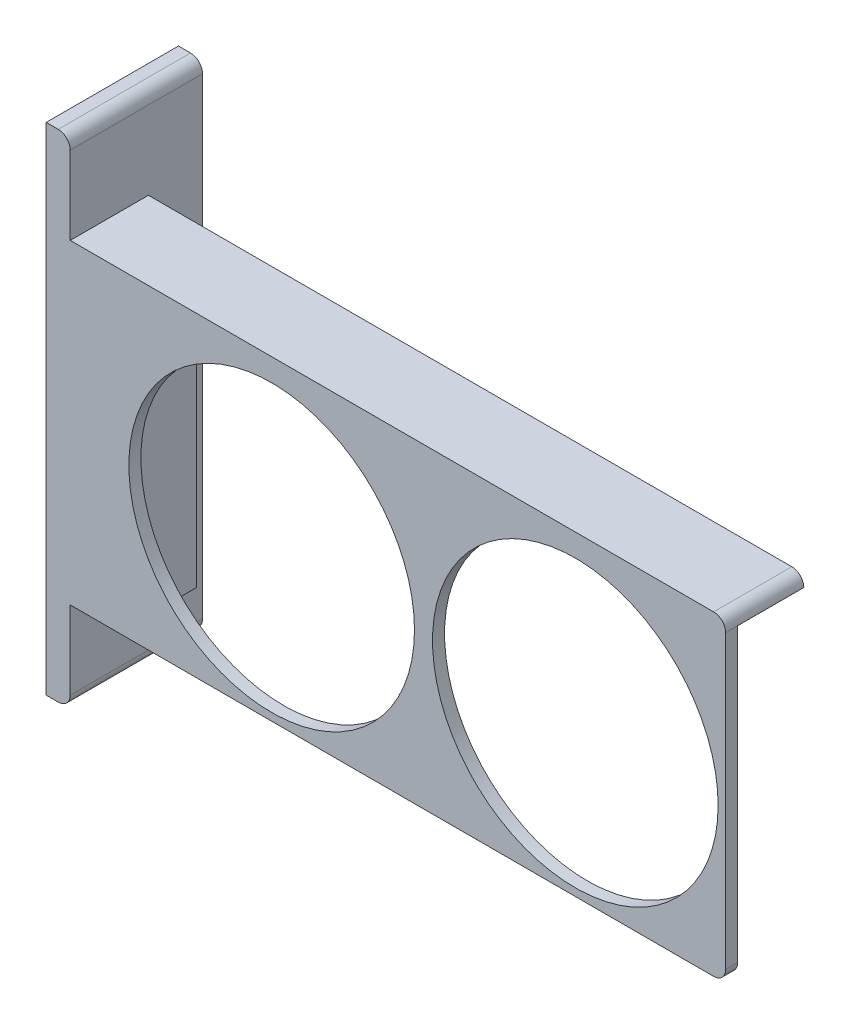
ISO-10303-21;
HEADER;
FILE_DESCRIPTION(('STEP AP214'),'2;1');
FILE_NAME('part.step','',(''),(''),'','','');
FILE_SCHEMA(('AUTOMOTIVE_DESIGN { 1 0 10303 214 1 1 1 1 }'));
ENDSEC;
DATA;
#1=APPLICATION_CONTEXT('core data for automotive mechanical design processes');
#2=APPLICATION_PROTOCOL_DEFINITION('international standard','automotive_design',2000,#1);
#3=PRODUCT_CONTEXT('',#1,'mechanical');
#4=PRODUCT('Part','Part','',(#3));
#5=PRODUCT_RELATED_PRODUCT_CATEGORY('part','',(#4));
#6=PRODUCT_DEFINITION_FORMATION('','',#4);
#7=PRODUCT_DEFINITION_CONTEXT('part definition',#1,'design');
#8=PRODUCT_DEFINITION('design','',#6,#7);
#9=PRODUCT_DEFINITION_SHAPE('','',#8);
#10=(LENGTH_UNIT() NAMED_UNIT(*) SI_UNIT(.MILLI.,.METRE.));
#11=(NAMED_UNIT(*) PLANE_ANGLE_UNIT() SI_UNIT($,.RADIAN.));
#12=(NAMED_UNIT(*) SI_UNIT($,.STERADIAN.) SOLID_ANGLE_UNIT());
#13=UNCERTAINTY_MEASURE_WITH_UNIT(LENGTH_MEASURE(1.E-05),#10,'distance_accuracy_value','');
#14=(GEOMETRIC_REPRESENTATION_CONTEXT(3) GLOBAL_UNCERTAINTY_ASSIGNED_CONTEXT((#13)) GLOBAL_UNIT_ASSIGNED_CONTEXT((#10,
#11,#12)) REPRESENTATION_CONTEXT('',''));
#15=CARTESIAN_POINT('',(0.,0.,0.));
#16=DIRECTION('',(0.,0.,1.));
#17=DIRECTION('',(1.,0.,0.));
#18=AXIS2_PLACEMENT_3D('',#15,#16,#17);
#19=CARTESIAN_POINT('',(0.,0.,0.));
#20=DIRECTION('',(0.,0.,-1.));
#21=DIRECTION('',(-1.,0.,0.));
#22=AXIS2_PLACEMENT_3D('',#19,#20,#21);
#23=PLANE('',#22);
#24=CARTESIAN_POINT('',(88.,25.,0.));
#25=DIRECTION('',(0.,0.,1.));
#26=DIRECTION('',(1.,0.,0.));
#27=AXIS2_PLACEMENT_3D('',#24,#25,#26);
#28=CIRCLE('',#27,23.75);
#29=CARTESIAN_POINT('',(111.75,25.,0.));
#30=VERTEX_POINT('',#29);
#31=EDGE_CURVE('E242',#30,#30,#28,.T.);
#32=ORIENTED_EDGE('',*,*,#31,.T.);
#33=EDGE_LOOP('',(#32));
#34=FACE_BOUND('',#33,.T.);
#35=CARTESIAN_POINT('',(37.5,25.,0.));
#36=DIRECTION('',(0.,0.,1.));
#37=DIRECTION('',(1.,0.,0.));
#38=AXIS2_PLACEMENT_3D('',#35,#36,#37);
#39=CIRCLE('',#38,23.75);
#40=CARTESIAN_POINT('',(61.25,25.,0.));
#41=VERTEX_POINT('',#40);
#42=EDGE_CURVE('E237',#41,#41,#39,.T.);
#43=ORIENTED_EDGE('',*,*,#42,.T.);
#44=EDGE_LOOP('',(#43));
#45=FACE_BOUND('',#44,.T.);
#46=DIRECTION('',(1.,0.,0.));
#47=VECTOR('',#46,1.);
#48=CARTESIAN_POINT('',(0.,0.,0.));
#49=LINE('',#48,#47);
#50=CARTESIAN_POINT('',(12.,0.,0.));
#51=VERTEX_POINT('',#50);
#52=CARTESIAN_POINT('',(111.,0.,0.));
#53=VERTEX_POINT('',#52);
#54=EDGE_CURVE('E250',#51,#53,#49,.T.);
#55=ORIENTED_EDGE('',*,*,#54,.F.);
#56=DIRECTION('',(0.,-1.,0.));
#57=VECTOR('',#56,1.);
#58=CARTESIAN_POINT('',(12.,0.,0.));
#59=LINE('',#58,#57);
#60=CARTESIAN_POINT('',(12.,50.5,0.));
#61=VERTEX_POINT('',#60);
#62=EDGE_CURVE('E198',#61,#51,#59,.T.);
#63=ORIENTED_EDGE('',*,*,#62,.F.);
#64=DIRECTION('',(-1.,0.,0.));
#65=VECTOR('',#64,1.);
#66=CARTESIAN_POINT('',(113.,50.5,0.));
#67=LINE('',#66,#65);
#68=CARTESIAN_POINT('',(113.,50.5,0.));
#69=VERTEX_POINT('',#68);
#70=EDGE_CURVE('E222',#69,#61,#67,.T.);
#71=ORIENTED_EDGE('',*,*,#70,.F.);
#72=DIRECTION('',(0.,1.,0.));
#73=VECTOR('',#72,1.);
#74=CARTESIAN_POINT('',(113.,0.,0.));
#75=LINE('',#74,#73);
#76=CARTESIAN_POINT('',(113.,2.,0.));
#77=VERTEX_POINT('',#76);
#78=EDGE_CURVE('E158',#77,#69,#75,.T.);
#79=ORIENTED_EDGE('',*,*,#78,.F.);
#80=CARTESIAN_POINT('',(111.,2.,0.));
#81=DIRECTION('',(0.,0.,-1.));
#82=DIRECTION('',(-1.,0.,0.));
#83=AXIS2_PLACEMENT_3D('',#80,#81,#82);
#84=CIRCLE('',#83,2.);
#85=EDGE_CURVE('E275',#77,#53,#84,.T.);
#86=ORIENTED_EDGE('',*,*,#85,.T.);
#87=EDGE_LOOP('',(#55,#63,#71,#79,#86));
#88=FACE_BOUND('',#87,.T.);
#89=ADVANCED_FACE('F41',(#34,#45,#88),#23,.T.);
#90=CARTESIAN_POINT('',(113.,50.5,-11.));
#91=DIRECTION('',(0.,1.,0.));
#92=DIRECTION('',(0.,0.,1.));
#93=AXIS2_PLACEMENT_3D('',#90,#91,#92);
#94=PLANE('',#93);
#95=DIRECTION('',(0.,0.,1.));
#96=VECTOR('',#95,1.);
#97=CARTESIAN_POINT('',(12.,50.5,-11.));
#98=LINE('',#97,#96);
#99=CARTESIAN_POINT('',(12.,50.5,-11.));
#100=VERTEX_POINT('',#99);
#101=EDGE_CURVE('E212',#100,#61,#98,.T.);
#102=ORIENTED_EDGE('',*,*,#101,.F.);
#103=DIRECTION('',(-1.,0.,0.));
#104=VECTOR('',#103,1.);
#105=CARTESIAN_POINT('',(113.,50.5,-11.));
#106=LINE('',#105,#104);
#107=CARTESIAN_POINT('',(113.,50.5,-11.));
#108=VERTEX_POINT('',#107);
#109=EDGE_CURVE('E223',#108,#100,#106,.T.);
#110=ORIENTED_EDGE('',*,*,#109,.F.);
#111=DIRECTION('',(0.,0.,1.));
#112=VECTOR('',#111,1.);
#113=CARTESIAN_POINT('',(113.,50.5,-11.));
#114=LINE('',#113,#112);
#115=EDGE_CURVE('E230',#108,#69,#114,.T.);
#116=ORIENTED_EDGE('',*,*,#115,.T.);
#117=ORIENTED_EDGE('',*,*,#70,.T.);
#118=EDGE_LOOP('',(#102,#110,#116,#117));
#119=FACE_BOUND('',#118,.T.);
#120=ADVANCED_FACE('F353',(#119),#94,.F.);
#121=CARTESIAN_POINT('',(0.,0.,-11.));
#122=DIRECTION('',(0.,0.,-1.));
#123=DIRECTION('',(-1.,0.,0.));
#124=AXIS2_PLACEMENT_3D('',#121,#122,#123);
#125=PLANE('',#124);
#126=ORIENTED_EDGE('',*,*,#109,.T.);
#127=DIRECTION('',(0.,-1.,0.));
#128=VECTOR('',#127,1.);
#129=CARTESIAN_POINT('',(12.,0.,-11.));
#130=LINE('',#129,#128);
#131=CARTESIAN_POINT('',(12.,0.,-11.));
#132=VERTEX_POINT('',#131);
#133=EDGE_CURVE('E199',#100,#132,#130,.T.);
#134=ORIENTED_EDGE('',*,*,#133,.T.);
#135=DIRECTION('',(-1.,0.,0.));
#136=VECTOR('',#135,1.);
#137=CARTESIAN_POINT('',(0.,0.,-11.));
#138=LINE('',#137,#136);
#139=CARTESIAN_POINT('',(4.,0.,-11.));
#140=VERTEX_POINT('',#139);
#141=EDGE_CURVE('E202',#132,#140,#138,.T.);
#142=ORIENTED_EDGE('',*,*,#141,.T.);
#143=DIRECTION('',(0.,1.,0.));
#144=VECTOR('',#143,1.);
#145=CARTESIAN_POINT('',(4.,0.,-11.));
#146=LINE('',#145,#144);
#147=CARTESIAN_POINT('',(4.,52.5,-11.));
#148=VERTEX_POINT('',#147);
#149=EDGE_CURVE('E296',#140,#148,#146,.T.);
#150=ORIENTED_EDGE('',*,*,#149,.T.);
#151=DIRECTION('',(1.,0.,0.));
#152=VECTOR('',#151,1.);
#153=CARTESIAN_POINT('',(113.,52.5,-11.));
#154=LINE('',#153,#152);
#155=CARTESIAN_POINT('',(111.,52.5,-11.));
#156=VERTEX_POINT('',#155);
#157=EDGE_CURVE('E227',#148,#156,#154,.T.);
#158=ORIENTED_EDGE('',*,*,#157,.T.);
#159=CARTESIAN_POINT('',(111.,50.5,-11.));
#160=DIRECTION('',(0.,0.,-1.));
#161=DIRECTION('',(-1.,0.,0.));
#162=AXIS2_PLACEMENT_3D('',#159,#160,#161);
#163=CIRCLE('',#162,2.);
#164=EDGE_CURVE('E293',#156,#108,#163,.T.);
#165=ORIENTED_EDGE('',*,*,#164,.T.);
#166=EDGE_LOOP('',(#126,#134,#142,#150,#158,#165));
#167=FACE_BOUND('',#166,.T.);
#168=ADVANCED_FACE('F363',(#167),#125,.T.);
#169=CARTESIAN_POINT('',(0.,0.,2.));
#170=DIRECTION('',(0.,0.,-1.));
#171=DIRECTION('',(-1.,0.,0.));
#172=AXIS2_PLACEMENT_3D('',#169,#170,#171);
#173=PLANE('',#172);
#174=DIRECTION('',(0.,1.,0.));
#175=VECTOR('',#174,1.);
#176=CARTESIAN_POINT('',(4.,-15.,2.));
#177=LINE('',#176,#175);
#178=CARTESIAN_POINT('',(4.,52.5,2.));
#179=VERTEX_POINT('',#178);
#180=CARTESIAN_POINT('',(4.,65.5,2.));
#181=VERTEX_POINT('',#180);
#182=EDGE_CURVE('E187',#179,#181,#177,.T.);
#183=ORIENTED_EDGE('',*,*,#182,.T.);
#184=CARTESIAN_POINT('',(2.,65.5,2.));
#185=DIRECTION('',(0.,0.,-1.));
#186=DIRECTION('',(-1.,0.,0.));
#187=AXIS2_PLACEMENT_3D('',#184,#185,#186);
#188=CIRCLE('',#187,2.);
#189=CARTESIAN_POINT('',(2.,67.5,2.));
#190=VERTEX_POINT('',#189);
#191=EDGE_CURVE('E50',#181,#190,#188,.F.);
#192=ORIENTED_EDGE('',*,*,#191,.T.);
#193=DIRECTION('',(1.,0.,0.));
#194=VECTOR('',#193,1.);
#195=CARTESIAN_POINT('',(0.,67.5,2.));
#196=LINE('',#195,#194);
#197=CARTESIAN_POINT('',(0.,67.5,2.));
#198=VERTEX_POINT('',#197);
#199=EDGE_CURVE('E161',#198,#190,#196,.T.);
#200=ORIENTED_EDGE('',*,*,#199,.F.);
#201=DIRECTION('',(0.,-1.,0.));
#202=VECTOR('',#201,1.);
#203=CARTESIAN_POINT('',(0.,0.,2.));
#204=LINE('',#203,#202);
#205=CARTESIAN_POINT('',(0.,-15.,2.));
#206=VERTEX_POINT('',#205);
#207=EDGE_CURVE('E147',#198,#206,#204,.T.);
#208=ORIENTED_EDGE('',*,*,#207,.T.);
#209=DIRECTION('',(1.,0.,0.));
#210=VECTOR('',#209,1.);
#211=CARTESIAN_POINT('',(0.,-15.,2.));
#212=LINE('',#211,#210);
#213=CARTESIAN_POINT('',(2.,-15.,2.));
#214=VERTEX_POINT('',#213);
#215=EDGE_CURVE('E181',#206,#214,#212,.T.);
#216=ORIENTED_EDGE('',*,*,#215,.T.);
#217=CARTESIAN_POINT('',(2.,-13.,2.));
#218=DIRECTION('',(0.,0.,-1.));
#219=DIRECTION('',(-1.,0.,0.));
#220=AXIS2_PLACEMENT_3D('',#217,#218,#219);
#221=CIRCLE('',#220,2.);
#222=CARTESIAN_POINT('',(4.,-13.,2.));
#223=VERTEX_POINT('',#222);
#224=EDGE_CURVE('E315',#214,#223,#221,.F.);
#225=ORIENTED_EDGE('',*,*,#224,.T.);
#226=CARTESIAN_POINT('',(4.,0.,2.));
#227=VERTEX_POINT('',#226);
#228=EDGE_CURVE('E188',#223,#227,#177,.T.);
#229=ORIENTED_EDGE('',*,*,#228,.T.);
#230=DIRECTION('',(1.,0.,0.));
#231=VECTOR('',#230,1.);
#232=CARTESIAN_POINT('',(0.,0.,2.));
#233=LINE('',#232,#231);
#234=CARTESIAN_POINT('',(111.,0.,2.));
#235=VERTEX_POINT('',#234);
#236=EDGE_CURVE('E157',#227,#235,#233,.T.);
#237=ORIENTED_EDGE('',*,*,#236,.T.);
#238=CARTESIAN_POINT('',(111.,2.,2.));
#239=DIRECTION('',(0.,0.,-1.));
#240=DIRECTION('',(-1.,0.,0.));
#241=AXIS2_PLACEMENT_3D('',#238,#239,#240);
#242=CIRCLE('',#241,2.);
#243=CARTESIAN_POINT('',(113.,2.,2.));
#244=VERTEX_POINT('',#243);
#245=EDGE_CURVE('E286',#235,#244,#242,.F.);
#246=ORIENTED_EDGE('',*,*,#245,.T.);
#247=DIRECTION('',(0.,1.,0.));
#248=VECTOR('',#247,1.);
#249=CARTESIAN_POINT('',(113.,0.,2.));
#250=LINE('',#249,#248);
#251=CARTESIAN_POINT('',(113.,50.5,2.));
#252=VERTEX_POINT('',#251);
#253=EDGE_CURVE('E256',#244,#252,#250,.T.);
#254=ORIENTED_EDGE('',*,*,#253,.T.);
#255=CARTESIAN_POINT('',(111.,50.5,2.));
#256=DIRECTION('',(0.,0.,-1.));
#257=DIRECTION('',(-1.,0.,0.));
#258=AXIS2_PLACEMENT_3D('',#255,#256,#257);
#259=CIRCLE('',#258,2.);
#260=CARTESIAN_POINT('',(111.,52.5,2.));
#261=VERTEX_POINT('',#260);
#262=EDGE_CURVE('E283',#252,#261,#259,.F.);
#263=ORIENTED_EDGE('',*,*,#262,.T.);
#264=DIRECTION('',(-1.,0.,0.));
#265=VECTOR('',#264,1.);
#266=CARTESIAN_POINT('',(0.,52.5,2.));
#267=LINE('',#266,#265);
#268=EDGE_CURVE('E260',#261,#179,#267,.T.);
#269=ORIENTED_EDGE('',*,*,#268,.T.);
#270=EDGE_LOOP('',(#183,#192,#200,#208,#216,#225,#229,#237,#246,#254,#263,#269));
#271=FACE_BOUND('',#270,.T.);
#272=CARTESIAN_POINT('',(88.,25.,2.));
#273=DIRECTION('',(0.,0.,1.));
#274=DIRECTION('',(1.,0.,0.));
#275=AXIS2_PLACEMENT_3D('',#272,#273,#274);
#276=CIRCLE('',#275,23.75);
#277=CARTESIAN_POINT('',(111.75,25.,2.));
#278=VERTEX_POINT('',#277);
#279=EDGE_CURVE('E246',#278,#278,#276,.T.);
#280=ORIENTED_EDGE('',*,*,#279,.F.);
#281=EDGE_LOOP('',(#280));
#282=FACE_BOUND('',#281,.T.);
#283=CARTESIAN_POINT('',(37.5,25.,2.));
#284=DIRECTION('',(0.,0.,1.));
#285=DIRECTION('',(1.,0.,0.));
#286=AXIS2_PLACEMENT_3D('',#283,#284,#285);
#287=CIRCLE('',#286,23.75);
#288=CARTESIAN_POINT('',(61.25,25.,2.));
#289=VERTEX_POINT('',#288);
#290=EDGE_CURVE('E238',#289,#289,#287,.T.);
#291=ORIENTED_EDGE('',*,*,#290,.F.);
#292=EDGE_LOOP('',(#291));
#293=FACE_BOUND('',#292,.T.);
#294=ADVANCED_FACE('F162',(#271,#282,#293),#173,.F.);
#295=CARTESIAN_POINT('',(0.,0.,2.));
#296=DIRECTION('',(1.,0.,0.));
#297=DIRECTION('',(0.,0.,-1.));
#298=AXIS2_PLACEMENT_3D('',#295,#296,#297);
#299=PLANE('',#298);
#300=DIRECTION('',(0.,1.,0.));
#301=VECTOR('',#300,1.);
#302=CARTESIAN_POINT('',(0.,0.,-20.));
#303=LINE('',#302,#301);
#304=CARTESIAN_POINT('',(0.,-15.,-20.));
#305=VERTEX_POINT('',#304);
#306=CARTESIAN_POINT('',(0.,67.5,-20.));
#307=VERTEX_POINT('',#306);
#308=EDGE_CURVE('E215',#305,#307,#303,.T.);
#309=ORIENTED_EDGE('',*,*,#308,.F.);
#310=DIRECTION('',(0.,0.,1.));
#311=VECTOR('',#310,1.);
#312=CARTESIAN_POINT('',(0.,-15.,-20.));
#313=LINE('',#312,#311);
#314=EDGE_CURVE('E154',#305,#206,#313,.T.);
#315=ORIENTED_EDGE('',*,*,#314,.T.);
#316=ORIENTED_EDGE('',*,*,#207,.F.);
#317=DIRECTION('',(0.,0.,1.));
#318=VECTOR('',#317,1.);
#319=CARTESIAN_POINT('',(0.,67.5,-20.));
#320=LINE('',#319,#318);
#321=EDGE_CURVE('E152',#307,#198,#320,.T.);
#322=ORIENTED_EDGE('',*,*,#321,.F.);
#323=EDGE_LOOP('',(#309,#315,#316,#322));
#324=FACE_BOUND('',#323,.T.);
#325=ADVANCED_FACE('F150',(#324),#299,.F.);
#326=CARTESIAN_POINT('',(0.,0.,2.));
#327=DIRECTION('',(0.,1.,0.));
#328=DIRECTION('',(0.,0.,1.));
#329=AXIS2_PLACEMENT_3D('',#326,#327,#328);
#330=PLANE('',#329);
#331=ORIENTED_EDGE('',*,*,#236,.F.);
#332=DIRECTION('',(0.,0.,-1.));
#333=VECTOR('',#332,1.);
#334=CARTESIAN_POINT('',(4.,0.,2.));
#335=LINE('',#334,#333);
#336=EDGE_CURVE('E195',#227,#140,#335,.T.);
#337=ORIENTED_EDGE('',*,*,#336,.T.);
#338=ORIENTED_EDGE('',*,*,#141,.F.);
#339=DIRECTION('',(0.,0.,1.));
#340=VECTOR('',#339,1.);
#341=CARTESIAN_POINT('',(12.,0.,-11.));
#342=LINE('',#341,#340);
#343=EDGE_CURVE('E206',#132,#51,#342,.T.);
#344=ORIENTED_EDGE('',*,*,#343,.T.);
#345=ORIENTED_EDGE('',*,*,#54,.T.);
#346=DIRECTION('',(0.,0.,-1.));
#347=VECTOR('',#346,1.);
#348=CARTESIAN_POINT('',(111.,0.,2.));
#349=LINE('',#348,#347);
#350=EDGE_CURVE('E279',#53,#235,#349,.F.);
#351=ORIENTED_EDGE('',*,*,#350,.T.);
#352=EDGE_LOOP('',(#331,#337,#338,#344,#345,#351));
#353=FACE_BOUND('',#352,.T.);
#354=ADVANCED_FACE('F337',(#353),#330,.F.);
#355=CARTESIAN_POINT('',(113.,0.,2.));
#356=DIRECTION('',(-1.,0.,0.));
#357=DIRECTION('',(0.,0.,1.));
#358=AXIS2_PLACEMENT_3D('',#355,#356,#357);
#359=PLANE('',#358);
#360=ORIENTED_EDGE('',*,*,#253,.F.);
#361=DIRECTION('',(0.,0.,-1.));
#362=VECTOR('',#361,1.);
#363=CARTESIAN_POINT('',(113.,2.,2.));
#364=LINE('',#363,#362);
#365=EDGE_CURVE('E271',#244,#77,#364,.T.);
#366=ORIENTED_EDGE('',*,*,#365,.T.);
#367=ORIENTED_EDGE('',*,*,#78,.T.);
#368=DIRECTION('',(0.,0.,-1.));
#369=VECTOR('',#368,1.);
#370=CARTESIAN_POINT('',(113.,50.5,2.));
#371=LINE('',#370,#369);
#372=EDGE_CURVE('E264',#69,#252,#371,.F.);
#373=ORIENTED_EDGE('',*,*,#372,.T.);
#374=EDGE_LOOP('',(#360,#366,#367,#373));
#375=FACE_BOUND('',#374,.T.);
#376=ADVANCED_FACE('F344',(#375),#359,.F.);
#377=CARTESIAN_POINT('',(0.,52.5,2.));
#378=DIRECTION('',(0.,-1.,0.));
#379=DIRECTION('',(0.,0.,-1.));
#380=AXIS2_PLACEMENT_3D('',#377,#378,#379);
#381=PLANE('',#380);
#382=ORIENTED_EDGE('',*,*,#157,.F.);
#383=DIRECTION('',(0.,0.,1.));
#384=VECTOR('',#383,1.);
#385=CARTESIAN_POINT('',(4.,52.5,2.));
#386=LINE('',#385,#384);
#387=EDGE_CURVE('E191',#148,#179,#386,.T.);
#388=ORIENTED_EDGE('',*,*,#387,.T.);
#389=ORIENTED_EDGE('',*,*,#268,.F.);
#390=DIRECTION('',(0.,0.,-1.));
#391=VECTOR('',#390,1.);
#392=CARTESIAN_POINT('',(111.,52.5,2.));
#393=LINE('',#392,#391);
#394=EDGE_CURVE('E289',#261,#156,#393,.T.);
#395=ORIENTED_EDGE('',*,*,#394,.T.);
#396=EDGE_LOOP('',(#382,#388,#389,#395));
#397=FACE_BOUND('',#396,.T.);
#398=ADVANCED_FACE('F361',(#397),#381,.F.);
#399=CARTESIAN_POINT('',(88.,25.,2.));
#400=DIRECTION('',(0.,0.,-1.));
#401=DIRECTION('',(-1.,0.,0.));
#402=AXIS2_PLACEMENT_3D('',#399,#400,#401);
#403=CYLINDRICAL_SURFACE('',#402,23.75);
#404=ORIENTED_EDGE('',*,*,#279,.T.);
#405=EDGE_LOOP('',(#404));
#406=FACE_BOUND('',#405,.T.);
#407=ORIENTED_EDGE('',*,*,#31,.F.);
#408=EDGE_LOOP('',(#407));
#409=FACE_BOUND('',#408,.T.);
#410=ADVANCED_FACE('F390',(#406,#409),#403,.F.);
#411=CARTESIAN_POINT('',(37.5,25.,2.));
#412=DIRECTION('',(0.,0.,-1.));
#413=DIRECTION('',(-1.,0.,0.));
#414=AXIS2_PLACEMENT_3D('',#411,#412,#413);
#415=CYLINDRICAL_SURFACE('',#414,23.75);
#416=ORIENTED_EDGE('',*,*,#290,.T.);
#417=EDGE_LOOP('',(#416));
#418=FACE_BOUND('',#417,.T.);
#419=ORIENTED_EDGE('',*,*,#42,.F.);
#420=EDGE_LOOP('',(#419));
#421=FACE_BOUND('',#420,.T.);
#422=ADVANCED_FACE('F399',(#418,#421),#415,.F.);
#423=CARTESIAN_POINT('',(111.,2.,2.));
#424=DIRECTION('',(0.,0.,-1.));
#425=DIRECTION('',(-1.,0.,0.));
#426=AXIS2_PLACEMENT_3D('',#423,#424,#425);
#427=CYLINDRICAL_SURFACE('',#426,2.);
#428=ORIENTED_EDGE('',*,*,#245,.F.);
#429=ORIENTED_EDGE('',*,*,#350,.F.);
#430=ORIENTED_EDGE('',*,*,#85,.F.);
#431=ORIENTED_EDGE('',*,*,#365,.F.);
#432=EDGE_LOOP('',(#428,#429,#430,#431));
#433=FACE_BOUND('',#432,.T.);
#434=ADVANCED_FACE('F341',(#433),#427,.T.);
#435=CARTESIAN_POINT('',(111.,50.5,2.));
#436=DIRECTION('',(0.,0.,-1.));
#437=DIRECTION('',(-1.,0.,0.));
#438=AXIS2_PLACEMENT_3D('',#435,#436,#437);
#439=CYLINDRICAL_SURFACE('',#438,2.);
#440=ORIENTED_EDGE('',*,*,#372,.F.);
#441=ORIENTED_EDGE('',*,*,#115,.F.);
#442=ORIENTED_EDGE('',*,*,#164,.F.);
#443=ORIENTED_EDGE('',*,*,#394,.F.);
#444=ORIENTED_EDGE('',*,*,#262,.F.);
#445=EDGE_LOOP('',(#440,#441,#442,#443,#444));
#446=FACE_BOUND('',#445,.T.);
#447=ADVANCED_FACE('F357',(#446),#439,.T.);
#448=CARTESIAN_POINT('',(4.,0.,-20.));
#449=DIRECTION('',(-1.,0.,0.));
#450=DIRECTION('',(0.,0.,1.));
#451=AXIS2_PLACEMENT_3D('',#448,#449,#450);
#452=PLANE('',#451);
#453=DIRECTION('',(0.,-1.,0.));
#454=VECTOR('',#453,1.);
#455=CARTESIAN_POINT('',(4.,0.,-20.));
#456=LINE('',#455,#454);
#457=CARTESIAN_POINT('',(4.,65.5,-20.));
#458=VERTEX_POINT('',#457);
#459=CARTESIAN_POINT('',(4.,-13.,-20.));
#460=VERTEX_POINT('',#459);
#461=EDGE_CURVE('E218',#458,#460,#456,.T.);
#462=ORIENTED_EDGE('',*,*,#461,.F.);
#463=DIRECTION('',(0.,0.,-1.));
#464=VECTOR('',#463,1.);
#465=CARTESIAN_POINT('',(4.,65.5,2.));
#466=LINE('',#465,#464);
#467=EDGE_CURVE('E63',#458,#181,#466,.F.);
#468=ORIENTED_EDGE('',*,*,#467,.T.);
#469=ORIENTED_EDGE('',*,*,#182,.F.);
#470=ORIENTED_EDGE('',*,*,#387,.F.);
#471=ORIENTED_EDGE('',*,*,#149,.F.);
#472=ORIENTED_EDGE('',*,*,#336,.F.);
#473=ORIENTED_EDGE('',*,*,#228,.F.);
#474=DIRECTION('',(0.,0.,-1.));
#475=VECTOR('',#474,1.);
#476=CARTESIAN_POINT('',(4.,-13.,-20.));
#477=LINE('',#476,#475);
#478=EDGE_CURVE('E309',#223,#460,#477,.T.);
#479=ORIENTED_EDGE('',*,*,#478,.T.);
#480=EDGE_LOOP('',(#462,#468,#469,#470,#471,#472,#473,#479));
#481=FACE_BOUND('',#480,.T.);
#482=ADVANCED_FACE('F329',(#481),#452,.F.);
#483=CARTESIAN_POINT('',(0.,0.,-20.));
#484=DIRECTION('',(0.,0.,-1.));
#485=DIRECTION('',(-1.,0.,0.));
#486=AXIS2_PLACEMENT_3D('',#483,#484,#485);
#487=PLANE('',#486);
#488=DIRECTION('',(-1.,0.,0.));
#489=VECTOR('',#488,1.);
#490=CARTESIAN_POINT('',(0.,67.5,-20.));
#491=LINE('',#490,#489);
#492=CARTESIAN_POINT('',(2.,67.5,-20.));
#493=VERTEX_POINT('',#492);
#494=EDGE_CURVE('E169',#493,#307,#491,.T.);
#495=ORIENTED_EDGE('',*,*,#494,.F.);
#496=CARTESIAN_POINT('',(2.,65.5,-20.));
#497=DIRECTION('',(0.,0.,-1.));
#498=DIRECTION('',(-1.,0.,0.));
#499=AXIS2_PLACEMENT_3D('',#496,#497,#498);
#500=CIRCLE('',#499,2.);
#501=EDGE_CURVE('E306',#493,#458,#500,.T.);
#502=ORIENTED_EDGE('',*,*,#501,.T.);
#503=ORIENTED_EDGE('',*,*,#461,.T.);
#504=CARTESIAN_POINT('',(2.,-13.,-20.));
#505=DIRECTION('',(0.,0.,-1.));
#506=DIRECTION('',(-1.,0.,0.));
#507=AXIS2_PLACEMENT_3D('',#504,#505,#506);
#508=CIRCLE('',#507,2.);
#509=CARTESIAN_POINT('',(2.,-15.,-20.));
#510=VERTEX_POINT('',#509);
#511=EDGE_CURVE('E303',#460,#510,#508,.T.);
#512=ORIENTED_EDGE('',*,*,#511,.T.);
#513=DIRECTION('',(-1.,0.,0.));
#514=VECTOR('',#513,1.);
#515=CARTESIAN_POINT('',(0.,-15.,-20.));
#516=LINE('',#515,#514);
#517=EDGE_CURVE('E184',#510,#305,#516,.T.);
#518=ORIENTED_EDGE('',*,*,#517,.T.);
#519=ORIENTED_EDGE('',*,*,#308,.T.);
#520=EDGE_LOOP('',(#495,#502,#503,#512,#518,#519));
#521=FACE_BOUND('',#520,.T.);
#522=ADVANCED_FACE('F323',(#521),#487,.T.);
#523=CARTESIAN_POINT('',(12.,0.,-11.));
#524=DIRECTION('',(-1.,0.,0.));
#525=DIRECTION('',(0.,0.,1.));
#526=AXIS2_PLACEMENT_3D('',#523,#524,#525);
#527=PLANE('',#526);
#528=ORIENTED_EDGE('',*,*,#62,.T.);
#529=ORIENTED_EDGE('',*,*,#343,.F.);
#530=ORIENTED_EDGE('',*,*,#133,.F.);
#531=ORIENTED_EDGE('',*,*,#101,.T.);
#532=EDGE_LOOP('',(#528,#529,#530,#531));
#533=FACE_BOUND('',#532,.T.);
#534=ADVANCED_FACE('F367',(#533),#527,.F.);
#535=CARTESIAN_POINT('',(0.,67.5,0.));
#536=DIRECTION('',(0.,1.,0.));
#537=DIRECTION('',(0.,0.,1.));
#538=AXIS2_PLACEMENT_3D('',#535,#536,#537);
#539=PLANE('',#538);
#540=ORIENTED_EDGE('',*,*,#199,.T.);
#541=DIRECTION('',(0.,0.,-1.));
#542=VECTOR('',#541,1.);
#543=CARTESIAN_POINT('',(2.,67.5,-20.));
#544=LINE('',#543,#542);
#545=EDGE_CURVE('E300',#190,#493,#544,.T.);
#546=ORIENTED_EDGE('',*,*,#545,.T.);
#547=ORIENTED_EDGE('',*,*,#494,.T.);
#548=ORIENTED_EDGE('',*,*,#321,.T.);
#549=EDGE_LOOP('',(#540,#546,#547,#548));
#550=FACE_BOUND('',#549,.T.);
#551=ADVANCED_FACE('F171',(#550),#539,.T.);
#552=CARTESIAN_POINT('',(0.,-15.,0.));
#553=DIRECTION('',(0.,1.,0.));
#554=DIRECTION('',(0.,0.,1.));
#555=AXIS2_PLACEMENT_3D('',#552,#553,#554);
#556=PLANE('',#555);
#557=ORIENTED_EDGE('',*,*,#517,.F.);
#558=DIRECTION('',(0.,0.,-1.));
#559=VECTOR('',#558,1.);
#560=CARTESIAN_POINT('',(2.,-15.,0.));
#561=LINE('',#560,#559);
#562=EDGE_CURVE('E11',#510,#214,#561,.F.);
#563=ORIENTED_EDGE('',*,*,#562,.T.);
#564=ORIENTED_EDGE('',*,*,#215,.F.);
#565=ORIENTED_EDGE('',*,*,#314,.F.);
#566=EDGE_LOOP('',(#557,#563,#564,#565));
#567=FACE_BOUND('',#566,.T.);
#568=ADVANCED_FACE('F324',(#567),#556,.F.);
#569=CARTESIAN_POINT('',(2.,65.5,0.));
#570=DIRECTION('',(0.,0.,1.));
#571=DIRECTION('',(1.,0.,0.));
#572=AXIS2_PLACEMENT_3D('',#569,#570,#571);
#573=CYLINDRICAL_SURFACE('',#572,2.);
#574=ORIENTED_EDGE('',*,*,#191,.F.);
#575=ORIENTED_EDGE('',*,*,#467,.F.);
#576=ORIENTED_EDGE('',*,*,#501,.F.);
#577=ORIENTED_EDGE('',*,*,#545,.F.);
#578=EDGE_LOOP('',(#574,#575,#576,#577));
#579=FACE_BOUND('',#578,.T.);
#580=ADVANCED_FACE('F321',(#579),#573,.T.);
#581=CARTESIAN_POINT('',(2.,-13.,-20.));
#582=DIRECTION('',(0.,0.,-1.));
#583=DIRECTION('',(-1.,0.,0.));
#584=AXIS2_PLACEMENT_3D('',#581,#582,#583);
#585=CYLINDRICAL_SURFACE('',#584,2.);
#586=ORIENTED_EDGE('',*,*,#224,.F.);
#587=ORIENTED_EDGE('',*,*,#562,.F.);
#588=ORIENTED_EDGE('',*,*,#511,.F.);
#589=ORIENTED_EDGE('',*,*,#478,.F.);
#590=EDGE_LOOP('',(#586,#587,#588,#589));
#591=FACE_BOUND('',#590,.T.);
#592=ADVANCED_FACE('F43',(#591),#585,.T.);
#593=CLOSED_SHELL('',(#89,#120,#168,#294,#325,#354,#376,#398,#410,#422,#434,#447,#482,#522,#534,
#551,#568,#580,#592));
#594=MANIFOLD_SOLID_BREP('B2',#593);
#595=ADVANCED_BREP_SHAPE_REPRESENTATION('',(#18,#594),#14);
#596=SHAPE_DEFINITION_REPRESENTATION(#9,#595);
ENDSEC;
END-ISO-10303-21;
